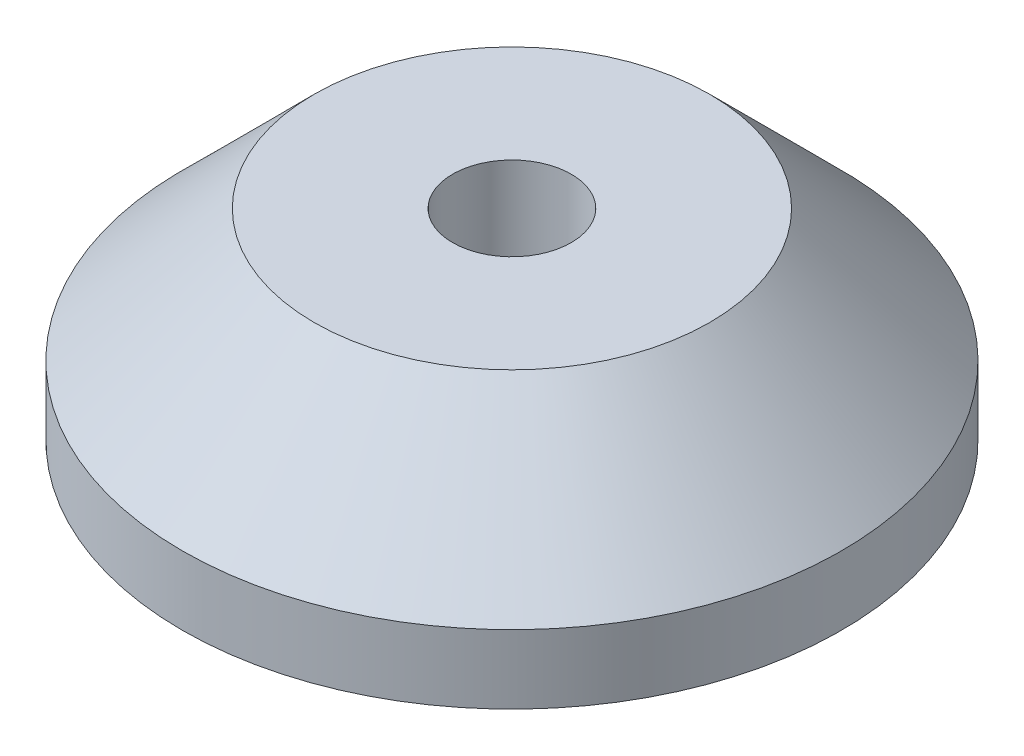
ISO-10303-21;
HEADER;
FILE_DESCRIPTION(('STEP AP214'),'2;1');
FILE_NAME('part.step','',(''),(''),'','','');
FILE_SCHEMA(('AUTOMOTIVE_DESIGN { 1 0 10303 214 1 1 1 1 }'));
ENDSEC;
DATA;
#1=APPLICATION_CONTEXT('core data for automotive mechanical design processes');
#2=APPLICATION_PROTOCOL_DEFINITION('international standard','automotive_design',2000,#1);
#3=PRODUCT_CONTEXT('',#1,'mechanical');
#4=PRODUCT('Part','Part','',(#3));
#5=PRODUCT_RELATED_PRODUCT_CATEGORY('part','',(#4));
#6=PRODUCT_DEFINITION_FORMATION('','',#4);
#7=PRODUCT_DEFINITION_CONTEXT('part definition',#1,'design');
#8=PRODUCT_DEFINITION('design','',#6,#7);
#9=PRODUCT_DEFINITION_SHAPE('','',#8);
#10=(LENGTH_UNIT() NAMED_UNIT(*) SI_UNIT(.MILLI.,.METRE.));
#11=(NAMED_UNIT(*) PLANE_ANGLE_UNIT() SI_UNIT($,.RADIAN.));
#12=(NAMED_UNIT(*) SI_UNIT($,.STERADIAN.) SOLID_ANGLE_UNIT());
#13=UNCERTAINTY_MEASURE_WITH_UNIT(LENGTH_MEASURE(1.E-05),#10,'distance_accuracy_value','');
#14=(GEOMETRIC_REPRESENTATION_CONTEXT(3) GLOBAL_UNCERTAINTY_ASSIGNED_CONTEXT((#13)) GLOBAL_UNIT_ASSIGNED_CONTEXT((#10,
#11,#12)) REPRESENTATION_CONTEXT('',''));
#15=CARTESIAN_POINT('',(0.,0.,0.));
#16=DIRECTION('',(0.,0.,1.));
#17=DIRECTION('',(1.,0.,0.));
#18=AXIS2_PLACEMENT_3D('',#15,#16,#17);
#19=CARTESIAN_POINT('',(0.,0.,0.));
#20=DIRECTION('',(0.,1.,0.));
#21=DIRECTION('',(0.,0.,1.));
#22=AXIS2_PLACEMENT_3D('',#19,#20,#21);
#23=PLANE('',#22);
#24=CARTESIAN_POINT('',(0.,0.,0.));
#25=DIRECTION('',(0.,1.,0.));
#26=DIRECTION('',(0.,0.,1.));
#27=AXIS2_PLACEMENT_3D('',#24,#25,#26);
#28=CIRCLE('',#27,17.907);
#29=CARTESIAN_POINT('',(0.,0.,17.907));
#30=VERTEX_POINT('',#29);
#31=EDGE_CURVE('E49',#30,#30,#28,.T.);
#32=ORIENTED_EDGE('',*,*,#31,.T.);
#33=EDGE_LOOP('',(#32));
#34=FACE_BOUND('',#33,.T.);
#35=CARTESIAN_POINT('',(0.,0.,0.));
#36=DIRECTION('',(0.,1.,0.));
#37=DIRECTION('',(0.,0.,1.));
#38=AXIS2_PLACEMENT_3D('',#35,#36,#37);
#39=CIRCLE('',#38,31.75);
#40=CARTESIAN_POINT('',(0.,0.,31.75));
#41=VERTEX_POINT('',#40);
#42=EDGE_CURVE('E54',#41,#41,#39,.T.);
#43=ORIENTED_EDGE('',*,*,#42,.F.);
#44=EDGE_LOOP('',(#43));
#45=FACE_BOUND('',#44,.T.);
#46=ADVANCED_FACE('F34',(#34,#45),#23,.F.);
#47=CARTESIAN_POINT('',(0.,5.1054,0.));
#48=DIRECTION('',(0.,-1.,0.));
#49=DIRECTION('',(0.,0.,-1.));
#50=AXIS2_PLACEMENT_3D('',#47,#48,#49);
#51=CYLINDRICAL_SURFACE('',#50,31.75);
#52=CARTESIAN_POINT('',(0.,6.62939999999996,0.));
#53=DIRECTION('',(0.,1.,0.));
#54=DIRECTION('',(0.,0.,1.));
#55=AXIS2_PLACEMENT_3D('',#52,#53,#54);
#56=CIRCLE('',#55,31.75);
#57=CARTESIAN_POINT('',(0.,6.62939999999996,31.75));
#58=VERTEX_POINT('',#57);
#59=EDGE_CURVE('E10',#58,#58,#56,.F.);
#60=ORIENTED_EDGE('',*,*,#59,.T.);
#61=EDGE_LOOP('',(#60));
#62=FACE_BOUND('',#61,.T.);
#63=ORIENTED_EDGE('',*,*,#42,.T.);
#64=EDGE_LOOP('',(#63));
#65=FACE_BOUND('',#64,.T.);
#66=ADVANCED_FACE('F84',(#62,#65),#51,.T.);
#67=CARTESIAN_POINT('',(0.,5.1054,0.));
#68=DIRECTION('',(0.,-1.,0.));
#69=DIRECTION('',(0.,0.,-1.));
#70=AXIS2_PLACEMENT_3D('',#67,#68,#69);
#71=CYLINDRICAL_SURFACE('',#70,12.827);
#72=CARTESIAN_POINT('',(0.,5.08000000000003,0.));
#73=DIRECTION('',(0.,1.,0.));
#74=DIRECTION('',(0.,0.,1.));
#75=AXIS2_PLACEMENT_3D('',#72,#73,#74);
#76=CIRCLE('',#75,12.827);
#77=CARTESIAN_POINT('',(0.,5.08000000000003,12.827));
#78=VERTEX_POINT('',#77);
#79=EDGE_CURVE('E45',#78,#78,#76,.F.);
#80=ORIENTED_EDGE('',*,*,#79,.T.);
#81=EDGE_LOOP('',(#80));
#82=FACE_BOUND('',#81,.T.);
#83=CARTESIAN_POINT('',(0.,5.1054,0.));
#84=DIRECTION('',(0.,1.,0.));
#85=DIRECTION('',(0.,0.,1.));
#86=AXIS2_PLACEMENT_3D('',#83,#84,#85);
#87=CIRCLE('',#86,12.827);
#88=CARTESIAN_POINT('',(0.,5.1054,12.827));
#89=VERTEX_POINT('',#88);
#90=EDGE_CURVE('E57',#89,#89,#87,.T.);
#91=ORIENTED_EDGE('',*,*,#90,.T.);
#92=EDGE_LOOP('',(#91));
#93=FACE_BOUND('',#92,.T.);
#94=ADVANCED_FACE('F80',(#82,#93),#71,.F.);
#95=CARTESIAN_POINT('',(0.,5.1054,0.));
#96=DIRECTION('',(0.,1.,0.));
#97=DIRECTION('',(0.,0.,1.));
#98=AXIS2_PLACEMENT_3D('',#95,#96,#97);
#99=PLANE('',#98);
#100=CARTESIAN_POINT('',(0.,5.1054,0.));
#101=DIRECTION('',(0.,1.,0.));
#102=DIRECTION('',(0.,0.,1.));
#103=AXIS2_PLACEMENT_3D('',#100,#101,#102);
#104=CIRCLE('',#103,5.715);
#105=CARTESIAN_POINT('',(0.,5.1054,5.715));
#106=VERTEX_POINT('',#105);
#107=EDGE_CURVE('E61',#106,#106,#104,.T.);
#108=ORIENTED_EDGE('',*,*,#107,.T.);
#109=EDGE_LOOP('',(#108));
#110=FACE_BOUND('',#109,.T.);
#111=ORIENTED_EDGE('',*,*,#90,.F.);
#112=EDGE_LOOP('',(#111));
#113=FACE_BOUND('',#112,.T.);
#114=ADVANCED_FACE('F72',(#110,#113),#99,.F.);
#115=CARTESIAN_POINT('',(0.,19.3294,0.));
#116=DIRECTION('',(0.,1.,0.));
#117=DIRECTION('',(0.,0.,1.));
#118=AXIS2_PLACEMENT_3D('',#115,#116,#117);
#119=PLANE('',#118);
#120=CARTESIAN_POINT('',(0.,19.3294,0.));
#121=DIRECTION('',(0.,1.,0.));
#122=DIRECTION('',(0.,0.,1.));
#123=AXIS2_PLACEMENT_3D('',#120,#121,#122);
#124=CIRCLE('',#123,19.05);
#125=CARTESIAN_POINT('',(0.,19.3294,19.05));
#126=VERTEX_POINT('',#125);
#127=EDGE_CURVE('E41',#126,#126,#124,.T.);
#128=ORIENTED_EDGE('',*,*,#127,.T.);
#129=EDGE_LOOP('',(#128));
#130=FACE_BOUND('',#129,.T.);
#131=CARTESIAN_POINT('',(0.,19.3294,0.));
#132=DIRECTION('',(0.,1.,0.));
#133=DIRECTION('',(0.,0.,1.));
#134=AXIS2_PLACEMENT_3D('',#131,#132,#133);
#135=CIRCLE('',#134,5.715);
#136=CARTESIAN_POINT('',(0.,19.3294,5.715));
#137=VERTEX_POINT('',#136);
#138=EDGE_CURVE('E60',#137,#137,#135,.T.);
#139=ORIENTED_EDGE('',*,*,#138,.F.);
#140=EDGE_LOOP('',(#139));
#141=FACE_BOUND('',#140,.T.);
#142=ADVANCED_FACE('F70',(#130,#141),#119,.T.);
#143=CARTESIAN_POINT('',(0.,19.3294,0.));
#144=DIRECTION('',(0.,-1.,0.));
#145=DIRECTION('',(0.,0.,-1.));
#146=AXIS2_PLACEMENT_3D('',#143,#144,#145);
#147=CYLINDRICAL_SURFACE('',#146,5.715);
#148=ORIENTED_EDGE('',*,*,#138,.T.);
#149=EDGE_LOOP('',(#148));
#150=FACE_BOUND('',#149,.T.);
#151=ORIENTED_EDGE('',*,*,#107,.F.);
#152=EDGE_LOOP('',(#151));
#153=FACE_BOUND('',#152,.T.);
#154=ADVANCED_FACE('F67',(#150,#153),#147,.F.);
#155=CARTESIAN_POINT('',(0.,0.,0.));
#156=DIRECTION('',(0.,-1.,0.));
#157=DIRECTION('',(0.,0.,-1.));
#158=AXIS2_PLACEMENT_3D('',#155,#156,#157);
#159=CONICAL_SURFACE('',#158,17.907,0.785398163397447);
#160=ORIENTED_EDGE('',*,*,#79,.F.);
#161=EDGE_LOOP('',(#160));
#162=FACE_BOUND('',#161,.T.);
#163=ORIENTED_EDGE('',*,*,#31,.F.);
#164=EDGE_LOOP('',(#163));
#165=FACE_BOUND('',#164,.T.);
#166=ADVANCED_FACE('F78',(#162,#165),#159,.F.);
#167=CARTESIAN_POINT('',(0.,19.3294,0.));
#168=DIRECTION('',(0.,-1.,0.));
#169=DIRECTION('',(0.,0.,-1.));
#170=AXIS2_PLACEMENT_3D('',#167,#168,#169);
#171=CONICAL_SURFACE('',#170,19.05,0.785398163397446);
#172=ORIENTED_EDGE('',*,*,#59,.F.);
#173=EDGE_LOOP('',(#172));
#174=FACE_BOUND('',#173,.T.);
#175=ORIENTED_EDGE('',*,*,#127,.F.);
#176=EDGE_LOOP('',(#175));
#177=FACE_BOUND('',#176,.T.);
#178=ADVANCED_FACE('F36',(#174,#177),#171,.T.);
#179=CLOSED_SHELL('',(#46,#66,#94,#114,#142,#154,#166,#178));
#180=MANIFOLD_SOLID_BREP('B2',#179);
#181=ADVANCED_BREP_SHAPE_REPRESENTATION('',(#18,#180),#14);
#182=SHAPE_DEFINITION_REPRESENTATION(#9,#181);
ENDSEC;
END-ISO-10303-21;
